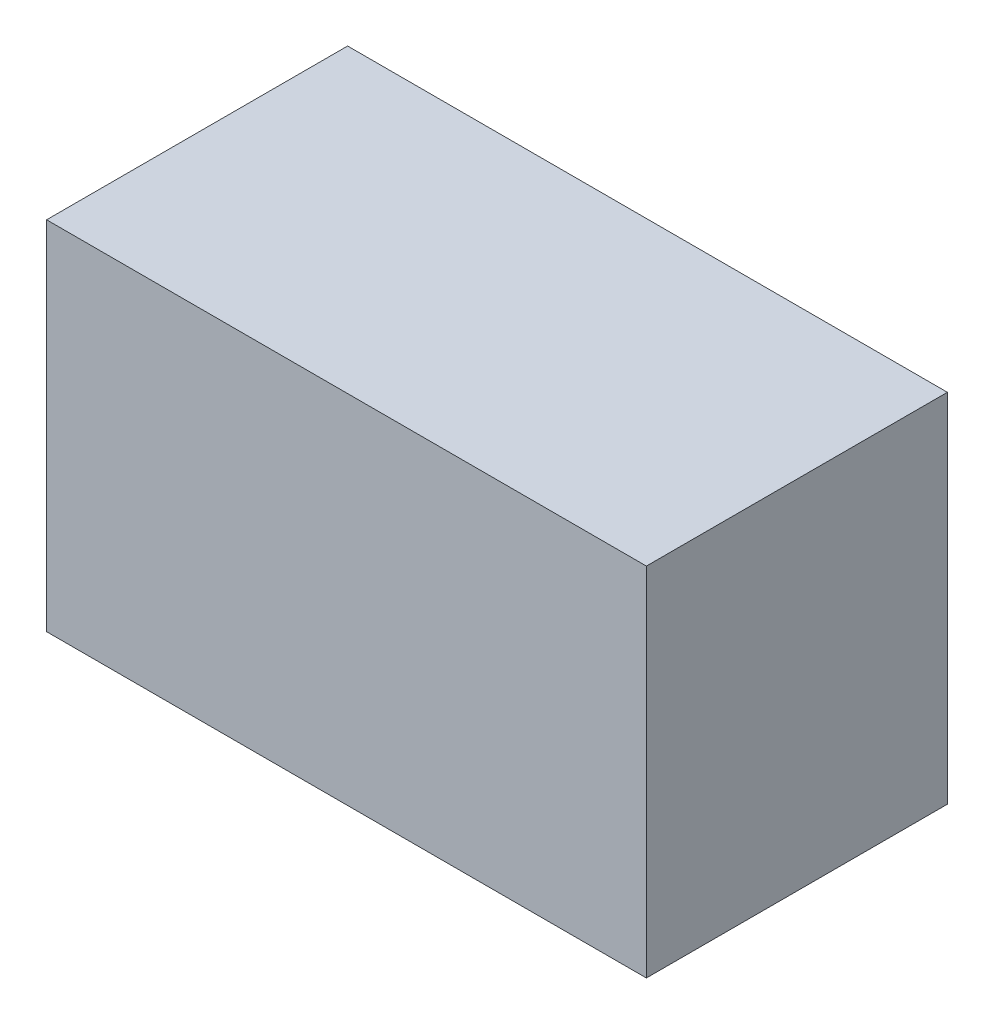
ISO-10303-21;
HEADER;
FILE_DESCRIPTION(('STEP AP214'),'2;1');
FILE_NAME('part.step','',(''),(''),'','','');
FILE_SCHEMA(('AUTOMOTIVE_DESIGN { 1 0 10303 214 1 1 1 1 }'));
ENDSEC;
DATA;
#1=APPLICATION_CONTEXT('core data for automotive mechanical design processes');
#2=APPLICATION_PROTOCOL_DEFINITION('international standard','automotive_design',2000,#1);
#3=PRODUCT_CONTEXT('',#1,'mechanical');
#4=PRODUCT('Part','Part','',(#3));
#5=PRODUCT_RELATED_PRODUCT_CATEGORY('part','',(#4));
#6=PRODUCT_DEFINITION_FORMATION('','',#4);
#7=PRODUCT_DEFINITION_CONTEXT('part definition',#1,'design');
#8=PRODUCT_DEFINITION('design','',#6,#7);
#9=PRODUCT_DEFINITION_SHAPE('','',#8);
#10=(LENGTH_UNIT() NAMED_UNIT(*) SI_UNIT(.MILLI.,.METRE.));
#11=(NAMED_UNIT(*) PLANE_ANGLE_UNIT() SI_UNIT($,.RADIAN.));
#12=(NAMED_UNIT(*) SI_UNIT($,.STERADIAN.) SOLID_ANGLE_UNIT());
#13=UNCERTAINTY_MEASURE_WITH_UNIT(LENGTH_MEASURE(1.E-05),#10,'distance_accuracy_value','');
#14=(GEOMETRIC_REPRESENTATION_CONTEXT(3) GLOBAL_UNCERTAINTY_ASSIGNED_CONTEXT((#13)) GLOBAL_UNIT_ASSIGNED_CONTEXT((#10,
#11,#12)) REPRESENTATION_CONTEXT('',''));
#15=CARTESIAN_POINT('',(0.,0.,0.));
#16=DIRECTION('',(0.,0.,1.));
#17=DIRECTION('',(1.,0.,0.));
#18=AXIS2_PLACEMENT_3D('',#15,#16,#17);
#19=CARTESIAN_POINT('',(-1.34501153877648,0.799986237690135,0.));
#20=DIRECTION('',(-1.,8.74227765734759E-08,0.));
#21=DIRECTION('',(-8.74227765734759E-08,-1.,0.));
#22=AXIS2_PLACEMENT_3D('',#19,#20,#21);
#23=PLANE('',#22);
#24=DIRECTION('',(-8.74227766240943E-08,-0.999999999999996,0.));
#25=VECTOR('',#24,1.);
#26=CARTESIAN_POINT('',(-1.34501153877648,0.799986237690135,0.));
#27=LINE('',#26,#25);
#28=CARTESIAN_POINT('',(-1.34501153877648,0.799986237690135,0.));
#29=VERTEX_POINT('',#28);
#30=CARTESIAN_POINT('',(-1.34501167865278,-0.800012236430959,0.));
#31=VERTEX_POINT('',#30);
#32=EDGE_CURVE('E11',#29,#31,#27,.T.);
#33=ORIENTED_EDGE('',*,*,#32,.T.);
#34=DIRECTION('',(0.,0.,1.));
#35=VECTOR('',#34,1.);
#36=CARTESIAN_POINT('',(-1.34501167865278,-0.800012236430959,0.));
#37=LINE('',#36,#35);
#38=CARTESIAN_POINT('',(-1.34501167865278,-0.800012236430959,1.34999978542328));
#39=VERTEX_POINT('',#38);
#40=EDGE_CURVE('E88',#31,#39,#37,.T.);
#41=ORIENTED_EDGE('',*,*,#40,.T.);
#42=DIRECTION('',(-8.74227766240943E-08,-0.999999999999996,0.));
#43=VECTOR('',#42,1.);
#44=CARTESIAN_POINT('',(-1.34501153877648,0.799986237690135,1.34999978542328));
#45=LINE('',#44,#43);
#46=CARTESIAN_POINT('',(-1.34501153877648,0.799986237690135,1.34999978542328));
#47=VERTEX_POINT('',#46);
#48=EDGE_CURVE('E83',#47,#39,#45,.T.);
#49=ORIENTED_EDGE('',*,*,#48,.F.);
#50=DIRECTION('',(0.,0.,1.));
#51=VECTOR('',#50,1.);
#52=CARTESIAN_POINT('',(-1.34501153877648,0.799986237690141,0.));
#53=LINE('',#52,#51);
#54=EDGE_CURVE('E72',#29,#47,#53,.T.);
#55=ORIENTED_EDGE('',*,*,#54,.F.);
#56=EDGE_LOOP('',(#33,#41,#49,#55));
#57=FACE_BOUND('',#56,.T.);
#58=ADVANCED_FACE('F17',(#57),#23,.T.);
#59=CARTESIAN_POINT('',(-1.34501167865278,-0.800012236430959,0.));
#60=DIRECTION('',(-8.74227765734759E-08,-1.,0.));
#61=DIRECTION('',(1.,-8.74227765734759E-08,0.));
#62=AXIS2_PLACEMENT_3D('',#59,#60,#61);
#63=PLANE('',#62);
#64=DIRECTION('',(0.999999999999996,-8.74227765583209E-08,0.));
#65=VECTOR('',#64,1.);
#66=CARTESIAN_POINT('',(-1.34501167865278,-0.800012236430959,0.));
#67=LINE('',#66,#65);
#68=CARTESIAN_POINT('',(1.34499076275347,-0.800012471598436,0.));
#69=VERTEX_POINT('',#68);
#70=EDGE_CURVE('E24',#31,#69,#67,.T.);
#71=ORIENTED_EDGE('',*,*,#70,.T.);
#72=DIRECTION('',(0.,0.,1.));
#73=VECTOR('',#72,1.);
#74=CARTESIAN_POINT('',(1.34499076275347,-0.800012471598441,0.));
#75=LINE('',#74,#73);
#76=CARTESIAN_POINT('',(1.34499076275347,-0.800012471598436,1.34999978542328));
#77=VERTEX_POINT('',#76);
#78=EDGE_CURVE('E85',#69,#77,#75,.T.);
#79=ORIENTED_EDGE('',*,*,#78,.T.);
#80=DIRECTION('',(0.999999999999996,-8.74227765583209E-08,0.));
#81=VECTOR('',#80,1.);
#82=CARTESIAN_POINT('',(-1.34501167865278,-0.800012236430959,1.34999978542328));
#83=LINE('',#82,#81);
#84=EDGE_CURVE('E66',#39,#77,#83,.T.);
#85=ORIENTED_EDGE('',*,*,#84,.F.);
#86=ORIENTED_EDGE('',*,*,#40,.F.);
#87=EDGE_LOOP('',(#71,#79,#85,#86));
#88=FACE_BOUND('',#87,.T.);
#89=ADVANCED_FACE('F89',(#88),#63,.T.);
#90=CARTESIAN_POINT('',(1.34499076275347,-0.800012471598436,0.));
#91=DIRECTION('',(1.,-8.74227765734759E-08,0.));
#92=DIRECTION('',(8.74227765734759E-08,1.,0.));
#93=AXIS2_PLACEMENT_3D('',#90,#91,#92);
#94=PLANE('',#93);
#95=DIRECTION('',(8.74227766240943E-08,0.999999999999996,0.));
#96=VECTOR('',#95,1.);
#97=CARTESIAN_POINT('',(1.34499076275347,-0.800012471598436,0.));
#98=LINE('',#97,#96);
#99=CARTESIAN_POINT('',(1.34499090262977,0.799986002522658,0.));
#100=VERTEX_POINT('',#99);
#101=EDGE_CURVE('E62',#69,#100,#98,.T.);
#102=ORIENTED_EDGE('',*,*,#101,.T.);
#103=DIRECTION('',(0.,0.,1.));
#104=VECTOR('',#103,1.);
#105=CARTESIAN_POINT('',(1.34499090262978,0.799986002522658,0.));
#106=LINE('',#105,#104);
#107=CARTESIAN_POINT('',(1.34499090262977,0.799986002522658,1.34999978542328));
#108=VERTEX_POINT('',#107);
#109=EDGE_CURVE('E55',#100,#108,#106,.T.);
#110=ORIENTED_EDGE('',*,*,#109,.T.);
#111=DIRECTION('',(8.74227766240943E-08,0.999999999999996,0.));
#112=VECTOR('',#111,1.);
#113=CARTESIAN_POINT('',(1.34499076275347,-0.800012471598436,1.34999978542328));
#114=LINE('',#113,#112);
#115=EDGE_CURVE('E59',#77,#108,#114,.T.);
#116=ORIENTED_EDGE('',*,*,#115,.F.);
#117=ORIENTED_EDGE('',*,*,#78,.F.);
#118=EDGE_LOOP('',(#102,#110,#116,#117));
#119=FACE_BOUND('',#118,.T.);
#120=ADVANCED_FACE('F57',(#119),#94,.T.);
#121=CARTESIAN_POINT('',(1.34499090262977,0.799986002522658,0.));
#122=DIRECTION('',(8.74227765734759E-08,1.,0.));
#123=DIRECTION('',(-1.,8.74227765734759E-08,0.));
#124=AXIS2_PLACEMENT_3D('',#121,#122,#123);
#125=PLANE('',#124);
#126=DIRECTION('',(-0.999999999999996,8.74227765583209E-08,0.));
#127=VECTOR('',#126,1.);
#128=CARTESIAN_POINT('',(1.34499090262977,0.799986002522658,0.));
#129=LINE('',#128,#127);
#130=EDGE_CURVE('E65',#100,#29,#129,.T.);
#131=ORIENTED_EDGE('',*,*,#130,.T.);
#132=ORIENTED_EDGE('',*,*,#54,.T.);
#133=DIRECTION('',(-0.999999999999996,8.74227765583209E-08,0.));
#134=VECTOR('',#133,1.);
#135=CARTESIAN_POINT('',(1.34499090262977,0.799986002522658,1.34999978542328));
#136=LINE('',#135,#134);
#137=EDGE_CURVE('E70',#108,#47,#136,.T.);
#138=ORIENTED_EDGE('',*,*,#137,.F.);
#139=ORIENTED_EDGE('',*,*,#109,.F.);
#140=EDGE_LOOP('',(#131,#132,#138,#139));
#141=FACE_BOUND('',#140,.T.);
#142=ADVANCED_FACE('F71',(#141),#125,.T.);
#143=CARTESIAN_POINT('',(242.674987792969,118.824966430664,1.34999978542328));
#144=DIRECTION('',(0.,0.,1.));
#145=DIRECTION('',(-1.,8.74227765734759E-08,0.));
#146=AXIS2_PLACEMENT_3D('',#143,#144,#145);
#147=PLANE('',#146);
#148=ORIENTED_EDGE('',*,*,#48,.T.);
#149=ORIENTED_EDGE('',*,*,#84,.T.);
#150=ORIENTED_EDGE('',*,*,#115,.T.);
#151=ORIENTED_EDGE('',*,*,#137,.T.);
#152=EDGE_LOOP('',(#148,#149,#150,#151));
#153=FACE_BOUND('',#152,.T.);
#154=ADVANCED_FACE('F76',(#153),#147,.T.);
#155=CARTESIAN_POINT('',(242.674987792969,118.824966430664,0.));
#156=DIRECTION('',(0.,0.,1.));
#157=DIRECTION('',(-1.,8.74227765734759E-08,0.));
#158=AXIS2_PLACEMENT_3D('',#155,#156,#157);
#159=PLANE('',#158);
#160=ORIENTED_EDGE('',*,*,#130,.F.);
#161=ORIENTED_EDGE('',*,*,#101,.F.);
#162=ORIENTED_EDGE('',*,*,#70,.F.);
#163=ORIENTED_EDGE('',*,*,#32,.F.);
#164=EDGE_LOOP('',(#160,#161,#162,#163));
#165=FACE_BOUND('',#164,.T.);
#166=ADVANCED_FACE('F91',(#165),#159,.F.);
#167=CLOSED_SHELL('',(#58,#89,#120,#142,#154,#166));
#168=MANIFOLD_SOLID_BREP('B1',#167);
#169=ADVANCED_BREP_SHAPE_REPRESENTATION('',(#18,#168),#14);
#170=SHAPE_DEFINITION_REPRESENTATION(#9,#169);
ENDSEC;
END-ISO-10303-21;
